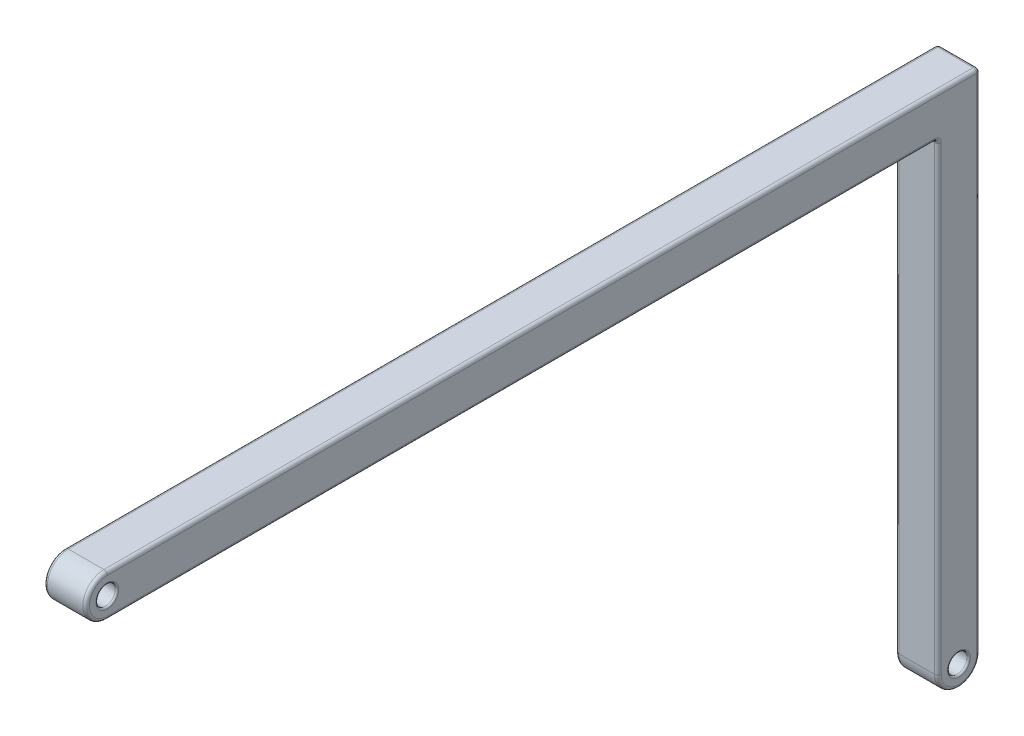
ISO-10303-21;
HEADER;
FILE_DESCRIPTION(('STEP AP214'),'2;1');
FILE_NAME('part.step','',(''),(''),'','','');
FILE_SCHEMA(('AUTOMOTIVE_DESIGN { 1 0 10303 214 1 1 1 1 }'));
ENDSEC;
DATA;
#1=APPLICATION_CONTEXT('core data for automotive mechanical design processes');
#2=APPLICATION_PROTOCOL_DEFINITION('international standard','automotive_design',2000,#1);
#3=PRODUCT_CONTEXT('',#1,'mechanical');
#4=PRODUCT('Part','Part','',(#3));
#5=PRODUCT_RELATED_PRODUCT_CATEGORY('part','',(#4));
#6=PRODUCT_DEFINITION_FORMATION('','',#4);
#7=PRODUCT_DEFINITION_CONTEXT('part definition',#1,'design');
#8=PRODUCT_DEFINITION('design','',#6,#7);
#9=PRODUCT_DEFINITION_SHAPE('','',#8);
#10=(LENGTH_UNIT() NAMED_UNIT(*) SI_UNIT(.MILLI.,.METRE.));
#11=(NAMED_UNIT(*) PLANE_ANGLE_UNIT() SI_UNIT($,.RADIAN.));
#12=(NAMED_UNIT(*) SI_UNIT($,.STERADIAN.) SOLID_ANGLE_UNIT());
#13=UNCERTAINTY_MEASURE_WITH_UNIT(LENGTH_MEASURE(1.E-05),#10,'distance_accuracy_value','');
#14=(GEOMETRIC_REPRESENTATION_CONTEXT(3) GLOBAL_UNCERTAINTY_ASSIGNED_CONTEXT((#13)) GLOBAL_UNIT_ASSIGNED_CONTEXT((#10,
#11,#12)) REPRESENTATION_CONTEXT('',''));
#15=CARTESIAN_POINT('',(0.,0.,0.));
#16=DIRECTION('',(0.,0.,1.));
#17=DIRECTION('',(1.,0.,0.));
#18=AXIS2_PLACEMENT_3D('',#15,#16,#17);
#19=CARTESIAN_POINT('',(2.5,-1.25,0.));
#20=DIRECTION('',(-1.,0.,0.));
#21=DIRECTION('',(0.,0.,1.));
#22=AXIS2_PLACEMENT_3D('',#19,#20,#21);
#23=PLANE('',#22);
#24=DIRECTION('',(0.,0.,1.));
#25=VECTOR('',#24,1.);
#26=CARTESIAN_POINT('',(2.5,-0.2,0.));
#27=LINE('',#26,#25);
#28=CARTESIAN_POINT('',(2.5,-0.2,-51.55));
#29=VERTEX_POINT('',#28);
#30=CARTESIAN_POINT('',(2.5,-0.2,0.));
#31=VERTEX_POINT('',#30);
#32=EDGE_CURVE('E304',#29,#31,#27,.T.);
#33=ORIENTED_EDGE('',*,*,#32,.T.);
#34=CARTESIAN_POINT('',(2.5,-1.25,0.));
#35=DIRECTION('',(-1.,0.,0.));
#36=DIRECTION('',(0.,0.,1.));
#37=AXIS2_PLACEMENT_3D('',#34,#35,#36);
#38=CIRCLE('',#37,1.05);
#39=CARTESIAN_POINT('',(2.5,-2.3,0.));
#40=VERTEX_POINT('',#39);
#41=EDGE_CURVE('E307',#31,#40,#38,.F.);
#42=ORIENTED_EDGE('',*,*,#41,.T.);
#43=DIRECTION('',(0.,0.,-1.));
#44=VECTOR('',#43,1.);
#45=CARTESIAN_POINT('',(2.5,-2.3,0.));
#46=LINE('',#45,#44);
#47=CARTESIAN_POINT('',(2.5,-2.3,-49.05));
#48=VERTEX_POINT('',#47);
#49=EDGE_CURVE('E157',#40,#48,#46,.T.);
#50=ORIENTED_EDGE('',*,*,#49,.T.);
#51=CARTESIAN_POINT('',(2.5,-2.7,-49.05));
#52=DIRECTION('',(-1.,0.,0.));
#53=DIRECTION('',(0.,0.,1.));
#54=AXIS2_PLACEMENT_3D('',#51,#52,#53);
#55=CIRCLE('',#54,0.4);
#56=CARTESIAN_POINT('',(2.5,-2.7,-49.45));
#57=VERTEX_POINT('',#56);
#58=EDGE_CURVE('E151',#57,#48,#55,.F.);
#59=ORIENTED_EDGE('',*,*,#58,.F.);
#60=DIRECTION('',(0.,-1.,0.));
#61=VECTOR('',#60,1.);
#62=CARTESIAN_POINT('',(2.5,-1.25,-49.45));
#63=LINE('',#62,#61);
#64=CARTESIAN_POINT('',(2.5,-30.,-49.45));
#65=VERTEX_POINT('',#64);
#66=EDGE_CURVE('E154',#57,#65,#63,.T.);
#67=ORIENTED_EDGE('',*,*,#66,.T.);
#68=CARTESIAN_POINT('',(2.5,-30.,-50.5));
#69=DIRECTION('',(-1.,0.,0.));
#70=DIRECTION('',(0.,0.,1.));
#71=AXIS2_PLACEMENT_3D('',#68,#69,#70);
#72=CIRCLE('',#71,1.05);
#73=CARTESIAN_POINT('',(2.5,-30.,-51.55));
#74=VERTEX_POINT('',#73);
#75=EDGE_CURVE('E173',#65,#74,#72,.F.);
#76=ORIENTED_EDGE('',*,*,#75,.T.);
#77=DIRECTION('',(0.,1.,0.));
#78=VECTOR('',#77,1.);
#79=CARTESIAN_POINT('',(2.5,-1.24999999999999,-51.55));
#80=LINE('',#79,#78);
#81=EDGE_CURVE('E162',#74,#29,#80,.T.);
#82=ORIENTED_EDGE('',*,*,#81,.T.);
#83=EDGE_LOOP('',(#33,#42,#50,#59,#67,#76,#82));
#84=FACE_BOUND('',#83,.T.);
#85=CARTESIAN_POINT('',(2.5,-30.,-50.5));
#86=DIRECTION('',(-1.,0.,0.));
#87=DIRECTION('',(0.,0.,1.));
#88=AXIS2_PLACEMENT_3D('',#85,#86,#87);
#89=CIRCLE('',#88,0.675000000000001);
#90=CARTESIAN_POINT('',(2.5,-30.,-49.825));
#91=VERTEX_POINT('',#90);
#92=EDGE_CURVE('E287',#91,#91,#89,.T.);
#93=ORIENTED_EDGE('',*,*,#92,.T.);
#94=EDGE_LOOP('',(#93));
#95=FACE_BOUND('',#94,.T.);
#96=CARTESIAN_POINT('',(2.5,-1.25,0.));
#97=DIRECTION('',(-1.,0.,0.));
#98=DIRECTION('',(0.,0.,1.));
#99=AXIS2_PLACEMENT_3D('',#96,#97,#98);
#100=CIRCLE('',#99,0.675);
#101=CARTESIAN_POINT('',(2.5,-1.25,0.675));
#102=VERTEX_POINT('',#101);
#103=EDGE_CURVE('E283',#102,#102,#100,.T.);
#104=ORIENTED_EDGE('',*,*,#103,.T.);
#105=EDGE_LOOP('',(#104));
#106=FACE_BOUND('',#105,.T.);
#107=ADVANCED_FACE('F45',(#84,#95,#106),#23,.F.);
#108=CARTESIAN_POINT('',(0.,-1.25,0.));
#109=DIRECTION('',(-1.,0.,0.));
#110=DIRECTION('',(0.,0.,1.));
#111=AXIS2_PLACEMENT_3D('',#108,#109,#110);
#112=PLANE('',#111);
#113=DIRECTION('',(0.,0.,-1.));
#114=VECTOR('',#113,1.);
#115=CARTESIAN_POINT('',(0.,-2.3,0.));
#116=LINE('',#115,#114);
#117=CARTESIAN_POINT('',(0.,-2.3,-49.05));
#118=VERTEX_POINT('',#117);
#119=CARTESIAN_POINT('',(0.,-2.3,0.));
#120=VERTEX_POINT('',#119);
#121=EDGE_CURVE('E339',#118,#120,#116,.F.);
#122=ORIENTED_EDGE('',*,*,#121,.T.);
#123=CARTESIAN_POINT('',(0.,-1.25,0.));
#124=DIRECTION('',(-1.,0.,0.));
#125=DIRECTION('',(0.,0.,1.));
#126=AXIS2_PLACEMENT_3D('',#123,#124,#125);
#127=CIRCLE('',#126,1.05);
#128=CARTESIAN_POINT('',(0.,-0.2,0.));
#129=VERTEX_POINT('',#128);
#130=EDGE_CURVE('E346',#120,#129,#127,.T.);
#131=ORIENTED_EDGE('',*,*,#130,.T.);
#132=DIRECTION('',(0.,0.,1.));
#133=VECTOR('',#132,1.);
#134=CARTESIAN_POINT('',(0.,-0.2,-51.75));
#135=LINE('',#134,#133);
#136=CARTESIAN_POINT('',(0.,-0.2,-51.55));
#137=VERTEX_POINT('',#136);
#138=EDGE_CURVE('E343',#129,#137,#135,.F.);
#139=ORIENTED_EDGE('',*,*,#138,.T.);
#140=DIRECTION('',(0.,1.,0.));
#141=VECTOR('',#140,1.);
#142=CARTESIAN_POINT('',(0.,-30.,-51.55));
#143=LINE('',#142,#141);
#144=CARTESIAN_POINT('',(0.,-30.,-51.55));
#145=VERTEX_POINT('',#144);
#146=EDGE_CURVE('E336',#137,#145,#143,.F.);
#147=ORIENTED_EDGE('',*,*,#146,.T.);
#148=CARTESIAN_POINT('',(0.,-30.,-50.5));
#149=DIRECTION('',(-1.,0.,0.));
#150=DIRECTION('',(0.,0.,1.));
#151=AXIS2_PLACEMENT_3D('',#148,#149,#150);
#152=CIRCLE('',#151,1.05);
#153=CARTESIAN_POINT('',(0.,-30.,-49.45));
#154=VERTEX_POINT('',#153);
#155=EDGE_CURVE('E333',#145,#154,#152,.T.);
#156=ORIENTED_EDGE('',*,*,#155,.T.);
#157=DIRECTION('',(0.,-1.,0.));
#158=VECTOR('',#157,1.);
#159=CARTESIAN_POINT('',(0.,-2.5,-49.45));
#160=LINE('',#159,#158);
#161=CARTESIAN_POINT('',(0.,-2.7,-49.45));
#162=VERTEX_POINT('',#161);
#163=EDGE_CURVE('E330',#154,#162,#160,.F.);
#164=ORIENTED_EDGE('',*,*,#163,.T.);
#165=CARTESIAN_POINT('',(0.,-2.7,-49.05));
#166=DIRECTION('',(-1.,0.,0.));
#167=DIRECTION('',(0.,0.,1.));
#168=AXIS2_PLACEMENT_3D('',#165,#166,#167);
#169=CIRCLE('',#168,0.4);
#170=EDGE_CURVE('E326',#118,#162,#169,.T.);
#171=ORIENTED_EDGE('',*,*,#170,.F.);
#172=EDGE_LOOP('',(#122,#131,#139,#147,#156,#164,#171));
#173=FACE_BOUND('',#172,.T.);
#174=CARTESIAN_POINT('',(0.,-30.,-50.5));
#175=DIRECTION('',(-1.,0.,0.));
#176=DIRECTION('',(0.,0.,1.));
#177=AXIS2_PLACEMENT_3D('',#174,#175,#176);
#178=CIRCLE('',#177,0.675000000000001);
#179=CARTESIAN_POINT('',(0.,-30.,-49.825));
#180=VERTEX_POINT('',#179);
#181=EDGE_CURVE('E271',#180,#180,#178,.F.);
#182=ORIENTED_EDGE('',*,*,#181,.T.);
#183=EDGE_LOOP('',(#182));
#184=FACE_BOUND('',#183,.T.);
#185=CARTESIAN_POINT('',(0.,-1.25,0.));
#186=DIRECTION('',(-1.,0.,0.));
#187=DIRECTION('',(0.,0.,1.));
#188=AXIS2_PLACEMENT_3D('',#185,#186,#187);
#189=CIRCLE('',#188,0.675);
#190=CARTESIAN_POINT('',(0.,-1.25,0.675));
#191=VERTEX_POINT('',#190);
#192=EDGE_CURVE('E267',#191,#191,#189,.F.);
#193=ORIENTED_EDGE('',*,*,#192,.T.);
#194=EDGE_LOOP('',(#193));
#195=FACE_BOUND('',#194,.T.);
#196=ADVANCED_FACE('F422',(#173,#184,#195),#112,.T.);
#197=CARTESIAN_POINT('',(2.5,-1.25,0.));
#198=DIRECTION('',(-1.,0.,0.));
#199=DIRECTION('',(0.,0.,1.));
#200=AXIS2_PLACEMENT_3D('',#197,#198,#199);
#201=CYLINDRICAL_SURFACE('',#200,1.25);
#202=DIRECTION('',(-1.,0.,0.));
#203=VECTOR('',#202,1.);
#204=CARTESIAN_POINT('',(2.5,-2.5,0.));
#205=LINE('',#204,#203);
#206=CARTESIAN_POINT('',(2.3,-2.5,0.));
#207=VERTEX_POINT('',#206);
#208=CARTESIAN_POINT('',(0.2,-2.5,0.));
#209=VERTEX_POINT('',#208);
#210=EDGE_CURVE('E263',#207,#209,#205,.T.);
#211=ORIENTED_EDGE('',*,*,#210,.F.);
#212=CARTESIAN_POINT('',(2.3,-1.25,0.));
#213=DIRECTION('',(-1.,0.,0.));
#214=DIRECTION('',(0.,0.,1.));
#215=AXIS2_PLACEMENT_3D('',#212,#213,#214);
#216=CIRCLE('',#215,1.25);
#217=CARTESIAN_POINT('',(2.3,0.,0.));
#218=VERTEX_POINT('',#217);
#219=EDGE_CURVE('E323',#207,#218,#216,.T.);
#220=ORIENTED_EDGE('',*,*,#219,.T.);
#221=DIRECTION('',(-1.,0.,0.));
#222=VECTOR('',#221,1.);
#223=CARTESIAN_POINT('',(2.5,0.,0.));
#224=LINE('',#223,#222);
#225=CARTESIAN_POINT('',(0.2,0.,0.));
#226=VERTEX_POINT('',#225);
#227=EDGE_CURVE('E246',#218,#226,#224,.T.);
#228=ORIENTED_EDGE('',*,*,#227,.T.);
#229=CARTESIAN_POINT('',(0.2,-1.25,0.));
#230=DIRECTION('',(-1.,0.,0.));
#231=DIRECTION('',(0.,0.,1.));
#232=AXIS2_PLACEMENT_3D('',#229,#230,#231);
#233=CIRCLE('',#232,1.25);
#234=EDGE_CURVE('E320',#226,#209,#233,.F.);
#235=ORIENTED_EDGE('',*,*,#234,.T.);
#236=EDGE_LOOP('',(#211,#220,#228,#235));
#237=FACE_BOUND('',#236,.T.);
#238=ADVANCED_FACE('F396',(#237),#201,.T.);
#239=CARTESIAN_POINT('',(2.5,-2.5,0.));
#240=DIRECTION('',(0.,1.,0.));
#241=DIRECTION('',(0.,0.,1.));
#242=AXIS2_PLACEMENT_3D('',#239,#240,#241);
#243=PLANE('',#242);
#244=DIRECTION('',(-1.,0.,0.));
#245=VECTOR('',#244,1.);
#246=CARTESIAN_POINT('',(2.5,-2.5,-49.05));
#247=LINE('',#246,#245);
#248=CARTESIAN_POINT('',(0.2,-2.5,-49.05));
#249=VERTEX_POINT('',#248);
#250=CARTESIAN_POINT('',(2.3,-2.5,-49.05));
#251=VERTEX_POINT('',#250);
#252=EDGE_CURVE('E310',#249,#251,#247,.F.);
#253=ORIENTED_EDGE('',*,*,#252,.T.);
#254=DIRECTION('',(0.,0.,-1.));
#255=VECTOR('',#254,1.);
#256=CARTESIAN_POINT('',(2.3,-2.5,0.));
#257=LINE('',#256,#255);
#258=EDGE_CURVE('E316',#251,#207,#257,.F.);
#259=ORIENTED_EDGE('',*,*,#258,.T.);
#260=ORIENTED_EDGE('',*,*,#210,.T.);
#261=DIRECTION('',(0.,0.,-1.));
#262=VECTOR('',#261,1.);
#263=CARTESIAN_POINT('',(0.2,-2.5,-49.25));
#264=LINE('',#263,#262);
#265=EDGE_CURVE('E313',#209,#249,#264,.T.);
#266=ORIENTED_EDGE('',*,*,#265,.T.);
#267=EDGE_LOOP('',(#253,#259,#260,#266));
#268=FACE_BOUND('',#267,.T.);
#269=ADVANCED_FACE('F393',(#268),#243,.F.);
#270=CARTESIAN_POINT('',(2.5,-30.,-49.25));
#271=DIRECTION('',(0.,0.,-1.));
#272=DIRECTION('',(-1.,0.,0.));
#273=AXIS2_PLACEMENT_3D('',#270,#271,#272);
#274=PLANE('',#273);
#275=DIRECTION('',(-1.,0.,0.));
#276=VECTOR('',#275,1.);
#277=CARTESIAN_POINT('',(2.5,-30.,-49.25));
#278=LINE('',#277,#276);
#279=CARTESIAN_POINT('',(2.3,-30.,-49.25));
#280=VERTEX_POINT('',#279);
#281=CARTESIAN_POINT('',(0.2,-30.,-49.25));
#282=VERTEX_POINT('',#281);
#283=EDGE_CURVE('E257',#280,#282,#278,.T.);
#284=ORIENTED_EDGE('',*,*,#283,.F.);
#285=DIRECTION('',(0.,-1.,0.));
#286=VECTOR('',#285,1.);
#287=CARTESIAN_POINT('',(2.3,-30.,-49.25));
#288=LINE('',#287,#286);
#289=CARTESIAN_POINT('',(2.3,-2.7,-49.25));
#290=VERTEX_POINT('',#289);
#291=EDGE_CURVE('E11',#280,#290,#288,.F.);
#292=ORIENTED_EDGE('',*,*,#291,.T.);
#293=DIRECTION('',(-1.,0.,0.));
#294=VECTOR('',#293,1.);
#295=CARTESIAN_POINT('',(0.,-2.7,-49.25));
#296=LINE('',#295,#294);
#297=CARTESIAN_POINT('',(0.2,-2.7,-49.25));
#298=VERTEX_POINT('',#297);
#299=EDGE_CURVE('E55',#290,#298,#296,.T.);
#300=ORIENTED_EDGE('',*,*,#299,.T.);
#301=DIRECTION('',(0.,-1.,0.));
#302=VECTOR('',#301,1.);
#303=CARTESIAN_POINT('',(0.2,-30.,-49.25));
#304=LINE('',#303,#302);
#305=EDGE_CURVE('E374',#298,#282,#304,.T.);
#306=ORIENTED_EDGE('',*,*,#305,.T.);
#307=EDGE_LOOP('',(#284,#292,#300,#306));
#308=FACE_BOUND('',#307,.T.);
#309=ADVANCED_FACE('F445',(#308),#274,.F.);
#310=CARTESIAN_POINT('',(2.5,-30.,-50.5));
#311=DIRECTION('',(-1.,0.,0.));
#312=DIRECTION('',(0.,0.,1.));
#313=AXIS2_PLACEMENT_3D('',#310,#311,#312);
#314=CYLINDRICAL_SURFACE('',#313,1.25);
#315=DIRECTION('',(-1.,0.,0.));
#316=VECTOR('',#315,1.);
#317=CARTESIAN_POINT('',(2.5,-30.,-51.75));
#318=LINE('',#317,#316);
#319=CARTESIAN_POINT('',(2.3,-30.,-51.75));
#320=VERTEX_POINT('',#319);
#321=CARTESIAN_POINT('',(0.2,-30.,-51.75));
#322=VERTEX_POINT('',#321);
#323=EDGE_CURVE('E250',#320,#322,#318,.T.);
#324=ORIENTED_EDGE('',*,*,#323,.F.);
#325=CARTESIAN_POINT('',(2.3,-30.,-50.5));
#326=DIRECTION('',(-1.,0.,0.));
#327=DIRECTION('',(0.,0.,1.));
#328=AXIS2_PLACEMENT_3D('',#325,#326,#327);
#329=CIRCLE('',#328,1.25);
#330=EDGE_CURVE('E362',#320,#280,#329,.T.);
#331=ORIENTED_EDGE('',*,*,#330,.T.);
#332=ORIENTED_EDGE('',*,*,#283,.T.);
#333=CARTESIAN_POINT('',(0.2,-30.,-50.5));
#334=DIRECTION('',(-1.,0.,0.));
#335=DIRECTION('',(0.,0.,1.));
#336=AXIS2_PLACEMENT_3D('',#333,#334,#335);
#337=CIRCLE('',#336,1.25);
#338=EDGE_CURVE('E359',#282,#322,#337,.F.);
#339=ORIENTED_EDGE('',*,*,#338,.T.);
#340=EDGE_LOOP('',(#324,#331,#332,#339));
#341=FACE_BOUND('',#340,.T.);
#342=ADVANCED_FACE('F441',(#341),#314,.T.);
#343=CARTESIAN_POINT('',(2.5,0.,-51.75));
#344=DIRECTION('',(0.,0.,1.));
#345=DIRECTION('',(0.,-1.,0.));
#346=AXIS2_PLACEMENT_3D('',#343,#344,#345);
#347=PLANE('',#346);
#348=DIRECTION('',(-1.,0.,0.));
#349=VECTOR('',#348,1.);
#350=CARTESIAN_POINT('',(2.5,-0.2,-51.75));
#351=LINE('',#350,#349);
#352=CARTESIAN_POINT('',(0.2,-0.2,-51.75));
#353=VERTEX_POINT('',#352);
#354=CARTESIAN_POINT('',(2.3,-0.2,-51.75));
#355=VERTEX_POINT('',#354);
#356=EDGE_CURVE('E349',#353,#355,#351,.F.);
#357=ORIENTED_EDGE('',*,*,#356,.T.);
#358=DIRECTION('',(0.,1.,0.));
#359=VECTOR('',#358,1.);
#360=CARTESIAN_POINT('',(2.3,0.,-51.75));
#361=LINE('',#360,#359);
#362=EDGE_CURVE('E355',#355,#320,#361,.F.);
#363=ORIENTED_EDGE('',*,*,#362,.T.);
#364=ORIENTED_EDGE('',*,*,#323,.T.);
#365=DIRECTION('',(0.,1.,0.));
#366=VECTOR('',#365,1.);
#367=CARTESIAN_POINT('',(0.2,0.,-51.75));
#368=LINE('',#367,#366);
#369=EDGE_CURVE('E352',#322,#353,#368,.T.);
#370=ORIENTED_EDGE('',*,*,#369,.T.);
#371=EDGE_LOOP('',(#357,#363,#364,#370));
#372=FACE_BOUND('',#371,.T.);
#373=ADVANCED_FACE('F437',(#372),#347,.F.);
#374=CARTESIAN_POINT('',(2.5,0.,0.));
#375=DIRECTION('',(0.,-1.,0.));
#376=DIRECTION('',(0.,0.,-1.));
#377=AXIS2_PLACEMENT_3D('',#374,#375,#376);
#378=PLANE('',#377);
#379=ORIENTED_EDGE('',*,*,#227,.F.);
#380=DIRECTION('',(0.,0.,1.));
#381=VECTOR('',#380,1.);
#382=CARTESIAN_POINT('',(2.3,0.,0.));
#383=LINE('',#382,#381);
#384=CARTESIAN_POINT('',(2.3,0.,-51.55));
#385=VERTEX_POINT('',#384);
#386=EDGE_CURVE('E371',#218,#385,#383,.F.);
#387=ORIENTED_EDGE('',*,*,#386,.T.);
#388=DIRECTION('',(-1.,0.,0.));
#389=VECTOR('',#388,1.);
#390=CARTESIAN_POINT('',(2.5,0.,-51.55));
#391=LINE('',#390,#389);
#392=CARTESIAN_POINT('',(0.2,0.,-51.55));
#393=VERTEX_POINT('',#392);
#394=EDGE_CURVE('E368',#385,#393,#391,.T.);
#395=ORIENTED_EDGE('',*,*,#394,.T.);
#396=DIRECTION('',(0.,0.,1.));
#397=VECTOR('',#396,1.);
#398=CARTESIAN_POINT('',(0.2,0.,0.));
#399=LINE('',#398,#397);
#400=EDGE_CURVE('E365',#393,#226,#399,.T.);
#401=ORIENTED_EDGE('',*,*,#400,.T.);
#402=EDGE_LOOP('',(#379,#387,#395,#401));
#403=FACE_BOUND('',#402,.T.);
#404=ADVANCED_FACE('F434',(#403),#378,.F.);
#405=CARTESIAN_POINT('',(2.5,-1.25,0.));
#406=DIRECTION('',(-1.,0.,0.));
#407=DIRECTION('',(0.,0.,1.));
#408=AXIS2_PLACEMENT_3D('',#405,#406,#407);
#409=CYLINDRICAL_SURFACE('',#408,0.575);
#410=CARTESIAN_POINT('',(0.0999999999999998,-1.25,0.));
#411=DIRECTION('',(-1.,0.,0.));
#412=DIRECTION('',(0.,0.,1.));
#413=AXIS2_PLACEMENT_3D('',#410,#411,#412);
#414=CIRCLE('',#413,0.575);
#415=CARTESIAN_POINT('',(0.0999999999999998,-1.25,0.575));
#416=VERTEX_POINT('',#415);
#417=EDGE_CURVE('E174',#416,#416,#414,.T.);
#418=ORIENTED_EDGE('',*,*,#417,.T.);
#419=EDGE_LOOP('',(#418));
#420=FACE_BOUND('',#419,.T.);
#421=CARTESIAN_POINT('',(2.4,-1.25,0.));
#422=DIRECTION('',(-1.,0.,0.));
#423=DIRECTION('',(0.,0.,1.));
#424=AXIS2_PLACEMENT_3D('',#421,#422,#423);
#425=CIRCLE('',#424,0.575);
#426=CARTESIAN_POINT('',(2.4,-1.25,0.575));
#427=VERTEX_POINT('',#426);
#428=EDGE_CURVE('E291',#427,#427,#425,.F.);
#429=ORIENTED_EDGE('',*,*,#428,.T.);
#430=EDGE_LOOP('',(#429));
#431=FACE_BOUND('',#430,.T.);
#432=ADVANCED_FACE('F431',(#420,#431),#409,.F.);
#433=CARTESIAN_POINT('',(2.5,-30.,-50.5));
#434=DIRECTION('',(-1.,0.,0.));
#435=DIRECTION('',(0.,0.,1.));
#436=AXIS2_PLACEMENT_3D('',#433,#434,#435);
#437=CYLINDRICAL_SURFACE('',#436,0.575000000000001);
#438=CARTESIAN_POINT('',(0.0999999999999998,-30.,-50.5));
#439=DIRECTION('',(-1.,0.,0.));
#440=DIRECTION('',(0.,0.,1.));
#441=AXIS2_PLACEMENT_3D('',#438,#439,#440);
#442=CIRCLE('',#441,0.575000000000001);
#443=CARTESIAN_POINT('',(0.0999999999999998,-30.,-49.925));
#444=VERTEX_POINT('',#443);
#445=EDGE_CURVE('E279',#444,#444,#442,.T.);
#446=ORIENTED_EDGE('',*,*,#445,.T.);
#447=EDGE_LOOP('',(#446));
#448=FACE_BOUND('',#447,.T.);
#449=CARTESIAN_POINT('',(2.4,-30.,-50.5));
#450=DIRECTION('',(-1.,0.,0.));
#451=DIRECTION('',(0.,0.,1.));
#452=AXIS2_PLACEMENT_3D('',#449,#450,#451);
#453=CIRCLE('',#452,0.575000000000001);
#454=CARTESIAN_POINT('',(2.4,-30.,-49.925));
#455=VERTEX_POINT('',#454);
#456=EDGE_CURVE('E275',#455,#455,#453,.F.);
#457=ORIENTED_EDGE('',*,*,#456,.T.);
#458=EDGE_LOOP('',(#457));
#459=FACE_BOUND('',#458,.T.);
#460=ADVANCED_FACE('F457',(#448,#459),#437,.F.);
#461=CARTESIAN_POINT('',(0.0999999999999998,-30.,-50.5));
#462=DIRECTION('',(-1.,0.,0.));
#463=DIRECTION('',(0.,0.,1.));
#464=AXIS2_PLACEMENT_3D('',#461,#462,#463);
#465=TOROIDAL_SURFACE('',#464,0.675000000000001,0.1);
#466=ORIENTED_EDGE('',*,*,#445,.F.);
#467=EDGE_LOOP('',(#466));
#468=FACE_BOUND('',#467,.T.);
#469=ORIENTED_EDGE('',*,*,#181,.F.);
#470=EDGE_LOOP('',(#469));
#471=FACE_BOUND('',#470,.T.);
#472=ADVANCED_FACE('F453',(#468,#471),#465,.T.);
#473=CARTESIAN_POINT('',(2.4,-30.,-50.5));
#474=DIRECTION('',(-1.,0.,0.));
#475=DIRECTION('',(0.,0.,1.));
#476=AXIS2_PLACEMENT_3D('',#473,#474,#475);
#477=TOROIDAL_SURFACE('',#476,0.675000000000001,0.1);
#478=ORIENTED_EDGE('',*,*,#92,.F.);
#479=EDGE_LOOP('',(#478));
#480=FACE_BOUND('',#479,.T.);
#481=ORIENTED_EDGE('',*,*,#456,.F.);
#482=EDGE_LOOP('',(#481));
#483=FACE_BOUND('',#482,.T.);
#484=ADVANCED_FACE('F456',(#480,#483),#477,.T.);
#485=CARTESIAN_POINT('',(0.0999999999999998,-1.25,0.));
#486=DIRECTION('',(-1.,0.,0.));
#487=DIRECTION('',(0.,0.,1.));
#488=AXIS2_PLACEMENT_3D('',#485,#486,#487);
#489=TOROIDAL_SURFACE('',#488,0.675,0.1);
#490=ORIENTED_EDGE('',*,*,#417,.F.);
#491=EDGE_LOOP('',(#490));
#492=FACE_BOUND('',#491,.T.);
#493=ORIENTED_EDGE('',*,*,#192,.F.);
#494=EDGE_LOOP('',(#493));
#495=FACE_BOUND('',#494,.T.);
#496=ADVANCED_FACE('F461',(#492,#495),#489,.T.);
#497=CARTESIAN_POINT('',(2.4,-1.25,0.));
#498=DIRECTION('',(-1.,0.,0.));
#499=DIRECTION('',(0.,0.,1.));
#500=AXIS2_PLACEMENT_3D('',#497,#498,#499);
#501=TOROIDAL_SURFACE('',#500,0.675,0.1);
#502=ORIENTED_EDGE('',*,*,#103,.F.);
#503=EDGE_LOOP('',(#502));
#504=FACE_BOUND('',#503,.T.);
#505=ORIENTED_EDGE('',*,*,#428,.F.);
#506=EDGE_LOOP('',(#505));
#507=FACE_BOUND('',#506,.T.);
#508=ADVANCED_FACE('F465',(#504,#507),#501,.T.);
#509=CARTESIAN_POINT('',(0.2,0.,-51.55));
#510=DIRECTION('',(0.,-1.,0.));
#511=DIRECTION('',(0.,0.,-1.));
#512=AXIS2_PLACEMENT_3D('',#509,#510,#511);
#513=CYLINDRICAL_SURFACE('',#512,0.2);
#514=CARTESIAN_POINT('',(0.2,-30.,-51.55));
#515=DIRECTION('',(0.,-1.,0.));
#516=DIRECTION('',(0.,0.,-1.));
#517=AXIS2_PLACEMENT_3D('',#514,#515,#516);
#518=CIRCLE('',#517,0.2);
#519=EDGE_CURVE('E235',#145,#322,#518,.T.);
#520=ORIENTED_EDGE('',*,*,#519,.F.);
#521=ORIENTED_EDGE('',*,*,#146,.F.);
#522=CARTESIAN_POINT('',(0.2,-0.2,-51.55));
#523=DIRECTION('',(0.,1.,0.));
#524=DIRECTION('',(0.,0.,1.));
#525=AXIS2_PLACEMENT_3D('',#522,#523,#524);
#526=CIRCLE('',#525,0.2);
#527=EDGE_CURVE('E238',#353,#137,#526,.T.);
#528=ORIENTED_EDGE('',*,*,#527,.F.);
#529=ORIENTED_EDGE('',*,*,#369,.F.);
#530=EDGE_LOOP('',(#520,#521,#528,#529));
#531=FACE_BOUND('',#530,.T.);
#532=ADVANCED_FACE('F47',(#531),#513,.T.);
#533=CARTESIAN_POINT('',(0.2,-0.2,0.));
#534=DIRECTION('',(0.,0.,-1.));
#535=DIRECTION('',(-1.,0.,0.));
#536=AXIS2_PLACEMENT_3D('',#533,#534,#535);
#537=CYLINDRICAL_SURFACE('',#536,0.2);
#538=CARTESIAN_POINT('',(0.2,-0.2,-51.55));
#539=DIRECTION('',(0.,0.,-1.));
#540=DIRECTION('',(-1.,0.,0.));
#541=AXIS2_PLACEMENT_3D('',#538,#539,#540);
#542=CIRCLE('',#541,0.2);
#543=EDGE_CURVE('E49',#137,#393,#542,.T.);
#544=ORIENTED_EDGE('',*,*,#543,.F.);
#545=ORIENTED_EDGE('',*,*,#138,.F.);
#546=CARTESIAN_POINT('',(0.2,-0.2,0.));
#547=DIRECTION('',(0.,0.,1.));
#548=DIRECTION('',(1.,0.,0.));
#549=AXIS2_PLACEMENT_3D('',#546,#547,#548);
#550=CIRCLE('',#549,0.2);
#551=EDGE_CURVE('E231',#226,#129,#550,.T.);
#552=ORIENTED_EDGE('',*,*,#551,.F.);
#553=ORIENTED_EDGE('',*,*,#400,.F.);
#554=EDGE_LOOP('',(#544,#545,#552,#553));
#555=FACE_BOUND('',#554,.T.);
#556=ADVANCED_FACE('F588',(#555),#537,.T.);
#557=CARTESIAN_POINT('',(0.2,-0.2,-51.55));
#558=DIRECTION('',(-1.,0.,0.));
#559=DIRECTION('',(0.,0.,1.));
#560=AXIS2_PLACEMENT_3D('',#557,#558,#559);
#561=SPHERICAL_SURFACE('',#560,0.2);
#562=ORIENTED_EDGE('',*,*,#527,.T.);
#563=ORIENTED_EDGE('',*,*,#543,.T.);
#564=CARTESIAN_POINT('',(0.2,-0.2,-51.55));
#565=DIRECTION('',(-1.,0.,0.));
#566=DIRECTION('',(0.,0.,1.));
#567=AXIS2_PLACEMENT_3D('',#564,#565,#566);
#568=CIRCLE('',#567,0.2);
#569=EDGE_CURVE('E227',#353,#393,#568,.F.);
#570=ORIENTED_EDGE('',*,*,#569,.F.);
#571=EDGE_LOOP('',(#562,#563,#570));
#572=FACE_BOUND('',#571,.T.);
#573=ADVANCED_FACE('F579',(#572),#561,.T.);
#574=CARTESIAN_POINT('',(0.2,-30.,-50.5));
#575=DIRECTION('',(-1.,0.,0.));
#576=DIRECTION('',(0.,0.,1.));
#577=AXIS2_PLACEMENT_3D('',#574,#575,#576);
#578=TOROIDAL_SURFACE('',#577,1.05,0.2);
#579=ORIENTED_EDGE('',*,*,#519,.T.);
#580=ORIENTED_EDGE('',*,*,#338,.F.);
#581=CARTESIAN_POINT('',(0.2,-30.,-49.45));
#582=DIRECTION('',(0.,1.,0.));
#583=DIRECTION('',(0.,0.,1.));
#584=AXIS2_PLACEMENT_3D('',#581,#582,#583);
#585=CIRCLE('',#584,0.2);
#586=EDGE_CURVE('E223',#154,#282,#585,.T.);
#587=ORIENTED_EDGE('',*,*,#586,.F.);
#588=ORIENTED_EDGE('',*,*,#155,.F.);
#589=EDGE_LOOP('',(#579,#580,#587,#588));
#590=FACE_BOUND('',#589,.T.);
#591=ADVANCED_FACE('F571',(#590),#578,.T.);
#592=CARTESIAN_POINT('',(0.2,-1.25,0.));
#593=DIRECTION('',(-1.,0.,0.));
#594=DIRECTION('',(0.,0.,1.));
#595=AXIS2_PLACEMENT_3D('',#592,#593,#594);
#596=TOROIDAL_SURFACE('',#595,1.05,0.2);
#597=ORIENTED_EDGE('',*,*,#551,.T.);
#598=ORIENTED_EDGE('',*,*,#130,.F.);
#599=CARTESIAN_POINT('',(0.2,-2.3,0.));
#600=DIRECTION('',(0.,0.,-1.));
#601=DIRECTION('',(0.,1.,0.));
#602=AXIS2_PLACEMENT_3D('',#599,#600,#601);
#603=CIRCLE('',#602,0.2);
#604=EDGE_CURVE('E220',#209,#120,#603,.T.);
#605=ORIENTED_EDGE('',*,*,#604,.F.);
#606=ORIENTED_EDGE('',*,*,#234,.F.);
#607=EDGE_LOOP('',(#597,#598,#605,#606));
#608=FACE_BOUND('',#607,.T.);
#609=ADVANCED_FACE('F399',(#608),#596,.T.);
#610=CARTESIAN_POINT('',(2.5,-0.2,-51.55));
#611=DIRECTION('',(-1.,0.,0.));
#612=DIRECTION('',(0.,0.,1.));
#613=AXIS2_PLACEMENT_3D('',#610,#611,#612);
#614=CYLINDRICAL_SURFACE('',#613,0.2);
#615=ORIENTED_EDGE('',*,*,#569,.T.);
#616=ORIENTED_EDGE('',*,*,#394,.F.);
#617=CARTESIAN_POINT('',(2.3,-0.2,-51.55));
#618=DIRECTION('',(1.,0.,0.));
#619=DIRECTION('',(0.,0.,-1.));
#620=AXIS2_PLACEMENT_3D('',#617,#618,#619);
#621=CIRCLE('',#620,0.2);
#622=EDGE_CURVE('E216',#355,#385,#621,.T.);
#623=ORIENTED_EDGE('',*,*,#622,.F.);
#624=ORIENTED_EDGE('',*,*,#356,.F.);
#625=EDGE_LOOP('',(#615,#616,#623,#624));
#626=FACE_BOUND('',#625,.T.);
#627=ADVANCED_FACE('F554',(#626),#614,.T.);
#628=CARTESIAN_POINT('',(2.3,-1.24999999999999,-51.55));
#629=DIRECTION('',(0.,1.,0.));
#630=DIRECTION('',(0.,0.,1.));
#631=AXIS2_PLACEMENT_3D('',#628,#629,#630);
#632=CYLINDRICAL_SURFACE('',#631,0.2);
#633=CARTESIAN_POINT('',(2.3,-30.,-51.55));
#634=DIRECTION('',(0.,-1.,0.));
#635=DIRECTION('',(0.,0.,-1.));
#636=AXIS2_PLACEMENT_3D('',#633,#634,#635);
#637=CIRCLE('',#636,0.2);
#638=EDGE_CURVE('E208',#320,#74,#637,.T.);
#639=ORIENTED_EDGE('',*,*,#638,.F.);
#640=ORIENTED_EDGE('',*,*,#362,.F.);
#641=CARTESIAN_POINT('',(2.3,-0.2,-51.55));
#642=DIRECTION('',(0.,1.,0.));
#643=DIRECTION('',(0.,0.,1.));
#644=AXIS2_PLACEMENT_3D('',#641,#642,#643);
#645=CIRCLE('',#644,0.2);
#646=EDGE_CURVE('E212',#29,#355,#645,.T.);
#647=ORIENTED_EDGE('',*,*,#646,.F.);
#648=ORIENTED_EDGE('',*,*,#81,.F.);
#649=EDGE_LOOP('',(#639,#640,#647,#648));
#650=FACE_BOUND('',#649,.T.);
#651=ADVANCED_FACE('F545',(#650),#632,.T.);
#652=CARTESIAN_POINT('',(0.2,-30.,-49.45));
#653=DIRECTION('',(0.,1.,0.));
#654=DIRECTION('',(0.,0.,1.));
#655=AXIS2_PLACEMENT_3D('',#652,#653,#654);
#656=CYLINDRICAL_SURFACE('',#655,0.2);
#657=ORIENTED_EDGE('',*,*,#586,.T.);
#658=ORIENTED_EDGE('',*,*,#305,.F.);
#659=CARTESIAN_POINT('',(0.2,-2.7,-49.45));
#660=DIRECTION('',(0.,1.,0.));
#661=DIRECTION('',(0.,0.,1.));
#662=AXIS2_PLACEMENT_3D('',#659,#660,#661);
#663=CIRCLE('',#662,0.2);
#664=EDGE_CURVE('E204',#162,#298,#663,.T.);
#665=ORIENTED_EDGE('',*,*,#664,.F.);
#666=ORIENTED_EDGE('',*,*,#163,.F.);
#667=EDGE_LOOP('',(#657,#658,#665,#666));
#668=FACE_BOUND('',#667,.T.);
#669=ADVANCED_FACE('F537',(#668),#656,.T.);
#670=CARTESIAN_POINT('',(0.2,-2.3,0.));
#671=DIRECTION('',(0.,0.,1.));
#672=DIRECTION('',(0.,-1.,0.));
#673=AXIS2_PLACEMENT_3D('',#670,#671,#672);
#674=CYLINDRICAL_SURFACE('',#673,0.2);
#675=ORIENTED_EDGE('',*,*,#604,.T.);
#676=ORIENTED_EDGE('',*,*,#121,.F.);
#677=CARTESIAN_POINT('',(0.2,-2.3,-49.05));
#678=DIRECTION('',(0.,0.,-1.));
#679=DIRECTION('',(-1.,0.,0.));
#680=AXIS2_PLACEMENT_3D('',#677,#678,#679);
#681=CIRCLE('',#680,0.2);
#682=EDGE_CURVE('E200',#249,#118,#681,.T.);
#683=ORIENTED_EDGE('',*,*,#682,.F.);
#684=ORIENTED_EDGE('',*,*,#265,.F.);
#685=EDGE_LOOP('',(#675,#676,#683,#684));
#686=FACE_BOUND('',#685,.T.);
#687=ADVANCED_FACE('F405',(#686),#674,.T.);
#688=CARTESIAN_POINT('',(2.3,-0.2,-51.55));
#689=DIRECTION('',(0.,0.,-1.));
#690=DIRECTION('',(0.,1.,0.));
#691=AXIS2_PLACEMENT_3D('',#688,#689,#690);
#692=SPHERICAL_SURFACE('',#691,0.2);
#693=ORIENTED_EDGE('',*,*,#646,.T.);
#694=ORIENTED_EDGE('',*,*,#622,.T.);
#695=CARTESIAN_POINT('',(2.3,-0.2,-51.55));
#696=DIRECTION('',(0.,0.,-1.));
#697=DIRECTION('',(-1.,0.,0.));
#698=AXIS2_PLACEMENT_3D('',#695,#696,#697);
#699=CIRCLE('',#698,0.2);
#700=EDGE_CURVE('E196',#29,#385,#699,.F.);
#701=ORIENTED_EDGE('',*,*,#700,.F.);
#702=EDGE_LOOP('',(#693,#694,#701));
#703=FACE_BOUND('',#702,.T.);
#704=ADVANCED_FACE('F520',(#703),#692,.T.);
#705=CARTESIAN_POINT('',(2.3,-30.,-50.5));
#706=DIRECTION('',(-1.,0.,0.));
#707=DIRECTION('',(0.,0.,1.));
#708=AXIS2_PLACEMENT_3D('',#705,#706,#707);
#709=TOROIDAL_SURFACE('',#708,1.05,0.2);
#710=ORIENTED_EDGE('',*,*,#638,.T.);
#711=ORIENTED_EDGE('',*,*,#75,.F.);
#712=CARTESIAN_POINT('',(2.3,-30.,-49.45));
#713=DIRECTION('',(0.,1.,0.));
#714=DIRECTION('',(0.,0.,1.));
#715=AXIS2_PLACEMENT_3D('',#712,#713,#714);
#716=CIRCLE('',#715,0.2);
#717=EDGE_CURVE('E171',#280,#65,#716,.T.);
#718=ORIENTED_EDGE('',*,*,#717,.F.);
#719=ORIENTED_EDGE('',*,*,#330,.F.);
#720=EDGE_LOOP('',(#710,#711,#718,#719));
#721=FACE_BOUND('',#720,.T.);
#722=ADVANCED_FACE('F512',(#721),#709,.T.);
#723=CARTESIAN_POINT('',(0.2,-2.7,-49.05));
#724=DIRECTION('',(-1.,0.,0.));
#725=DIRECTION('',(0.,0.,1.));
#726=AXIS2_PLACEMENT_3D('',#723,#724,#725);
#727=TOROIDAL_SURFACE('',#726,0.4,0.2);
#728=ORIENTED_EDGE('',*,*,#170,.T.);
#729=ORIENTED_EDGE('',*,*,#664,.T.);
#730=CARTESIAN_POINT('',(0.2,-2.7,-49.05));
#731=DIRECTION('',(-1.,0.,0.));
#732=DIRECTION('',(0.,0.,1.));
#733=AXIS2_PLACEMENT_3D('',#730,#731,#732);
#734=CIRCLE('',#733,0.2);
#735=EDGE_CURVE('E185',#249,#298,#734,.T.);
#736=ORIENTED_EDGE('',*,*,#735,.F.);
#737=ORIENTED_EDGE('',*,*,#682,.T.);
#738=EDGE_LOOP('',(#728,#729,#736,#737));
#739=FACE_BOUND('',#738,.T.);
#740=ADVANCED_FACE('F408',(#739),#727,.T.);
#741=CARTESIAN_POINT('',(2.3,-0.2,0.));
#742=DIRECTION('',(0.,0.,1.));
#743=DIRECTION('',(1.,0.,0.));
#744=AXIS2_PLACEMENT_3D('',#741,#742,#743);
#745=CYLINDRICAL_SURFACE('',#744,0.2);
#746=ORIENTED_EDGE('',*,*,#700,.T.);
#747=ORIENTED_EDGE('',*,*,#386,.F.);
#748=CARTESIAN_POINT('',(2.3,-0.2,0.));
#749=DIRECTION('',(0.,0.,1.));
#750=DIRECTION('',(0.,-1.,0.));
#751=AXIS2_PLACEMENT_3D('',#748,#749,#750);
#752=CIRCLE('',#751,0.2);
#753=EDGE_CURVE('E180',#31,#218,#752,.T.);
#754=ORIENTED_EDGE('',*,*,#753,.F.);
#755=ORIENTED_EDGE('',*,*,#32,.F.);
#756=EDGE_LOOP('',(#746,#747,#754,#755));
#757=FACE_BOUND('',#756,.T.);
#758=ADVANCED_FACE('F419',(#757),#745,.T.);
#759=CARTESIAN_POINT('',(2.3,-1.25,-49.45));
#760=DIRECTION('',(0.,-1.,0.));
#761=DIRECTION('',(0.,0.,-1.));
#762=AXIS2_PLACEMENT_3D('',#759,#760,#761);
#763=CYLINDRICAL_SURFACE('',#762,0.2);
#764=ORIENTED_EDGE('',*,*,#717,.T.);
#765=ORIENTED_EDGE('',*,*,#66,.F.);
#766=CARTESIAN_POINT('',(2.3,-2.7,-49.45));
#767=DIRECTION('',(0.,1.,0.));
#768=DIRECTION('',(0.,0.,1.));
#769=AXIS2_PLACEMENT_3D('',#766,#767,#768);
#770=CIRCLE('',#769,0.2);
#771=EDGE_CURVE('E168',#290,#57,#770,.T.);
#772=ORIENTED_EDGE('',*,*,#771,.F.);
#773=ORIENTED_EDGE('',*,*,#291,.F.);
#774=EDGE_LOOP('',(#764,#765,#772,#773));
#775=FACE_BOUND('',#774,.T.);
#776=ADVANCED_FACE('F167',(#775),#763,.T.);
#777=CARTESIAN_POINT('',(2.5,-2.7,-49.05));
#778=DIRECTION('',(1.,0.,0.));
#779=DIRECTION('',(0.,0.,-1.));
#780=AXIS2_PLACEMENT_3D('',#777,#778,#779);
#781=CYLINDRICAL_SURFACE('',#780,0.2);
#782=ORIENTED_EDGE('',*,*,#735,.T.);
#783=ORIENTED_EDGE('',*,*,#299,.F.);
#784=CARTESIAN_POINT('',(2.3,-2.7,-49.05));
#785=DIRECTION('',(-1.,0.,0.));
#786=DIRECTION('',(0.,0.,1.));
#787=AXIS2_PLACEMENT_3D('',#784,#785,#786);
#788=CIRCLE('',#787,0.2);
#789=EDGE_CURVE('E178',#251,#290,#788,.T.);
#790=ORIENTED_EDGE('',*,*,#789,.F.);
#791=ORIENTED_EDGE('',*,*,#252,.F.);
#792=EDGE_LOOP('',(#782,#783,#790,#791));
#793=FACE_BOUND('',#792,.T.);
#794=ADVANCED_FACE('F411',(#793),#781,.F.);
#795=CARTESIAN_POINT('',(2.3,-1.25,0.));
#796=DIRECTION('',(-1.,0.,0.));
#797=DIRECTION('',(0.,0.,1.));
#798=AXIS2_PLACEMENT_3D('',#795,#796,#797);
#799=TOROIDAL_SURFACE('',#798,1.05,0.2);
#800=ORIENTED_EDGE('',*,*,#753,.T.);
#801=ORIENTED_EDGE('',*,*,#219,.F.);
#802=CARTESIAN_POINT('',(2.3,-2.3,0.));
#803=DIRECTION('',(0.,0.,-1.));
#804=DIRECTION('',(0.,1.,0.));
#805=AXIS2_PLACEMENT_3D('',#802,#803,#804);
#806=CIRCLE('',#805,0.2);
#807=EDGE_CURVE('E187',#40,#207,#806,.T.);
#808=ORIENTED_EDGE('',*,*,#807,.F.);
#809=ORIENTED_EDGE('',*,*,#41,.F.);
#810=EDGE_LOOP('',(#800,#801,#808,#809));
#811=FACE_BOUND('',#810,.T.);
#812=ADVANCED_FACE('F389',(#811),#799,.T.);
#813=CARTESIAN_POINT('',(2.3,-2.7,-49.05));
#814=DIRECTION('',(-1.,0.,0.));
#815=DIRECTION('',(0.,0.,1.));
#816=AXIS2_PLACEMENT_3D('',#813,#814,#815);
#817=TOROIDAL_SURFACE('',#816,0.4,0.2);
#818=ORIENTED_EDGE('',*,*,#771,.T.);
#819=ORIENTED_EDGE('',*,*,#58,.T.);
#820=CARTESIAN_POINT('',(2.3,-2.3,-49.05));
#821=DIRECTION('',(0.,0.,-1.));
#822=DIRECTION('',(-1.,0.,0.));
#823=AXIS2_PLACEMENT_3D('',#820,#821,#822);
#824=CIRCLE('',#823,0.2);
#825=EDGE_CURVE('E379',#251,#48,#824,.F.);
#826=ORIENTED_EDGE('',*,*,#825,.F.);
#827=ORIENTED_EDGE('',*,*,#789,.T.);
#828=EDGE_LOOP('',(#818,#819,#826,#827));
#829=FACE_BOUND('',#828,.T.);
#830=ADVANCED_FACE('F176',(#829),#817,.T.);
#831=CARTESIAN_POINT('',(2.3,-2.3,0.));
#832=DIRECTION('',(0.,0.,-1.));
#833=DIRECTION('',(0.,1.,0.));
#834=AXIS2_PLACEMENT_3D('',#831,#832,#833);
#835=CYLINDRICAL_SURFACE('',#834,0.2);
#836=ORIENTED_EDGE('',*,*,#807,.T.);
#837=ORIENTED_EDGE('',*,*,#258,.F.);
#838=ORIENTED_EDGE('',*,*,#825,.T.);
#839=ORIENTED_EDGE('',*,*,#49,.F.);
#840=EDGE_LOOP('',(#836,#837,#838,#839));
#841=FACE_BOUND('',#840,.T.);
#842=ADVANCED_FACE('F386',(#841),#835,.T.);
#843=CLOSED_SHELL('',(#107,#196,#238,#269,#309,#342,#373,#404,#432,#460,#472,#484,#496,#508,
#532,#556,#573,#591,#609,#627,#651,#669,#687,#704,#722,#740,#758,#776,#794,#812,#830,#842));
#844=MANIFOLD_SOLID_BREP('B2',#843);
#845=ADVANCED_BREP_SHAPE_REPRESENTATION('',(#18,#844),#14);
#846=SHAPE_DEFINITION_REPRESENTATION(#9,#845);
ENDSEC;
END-ISO-10303-21;
